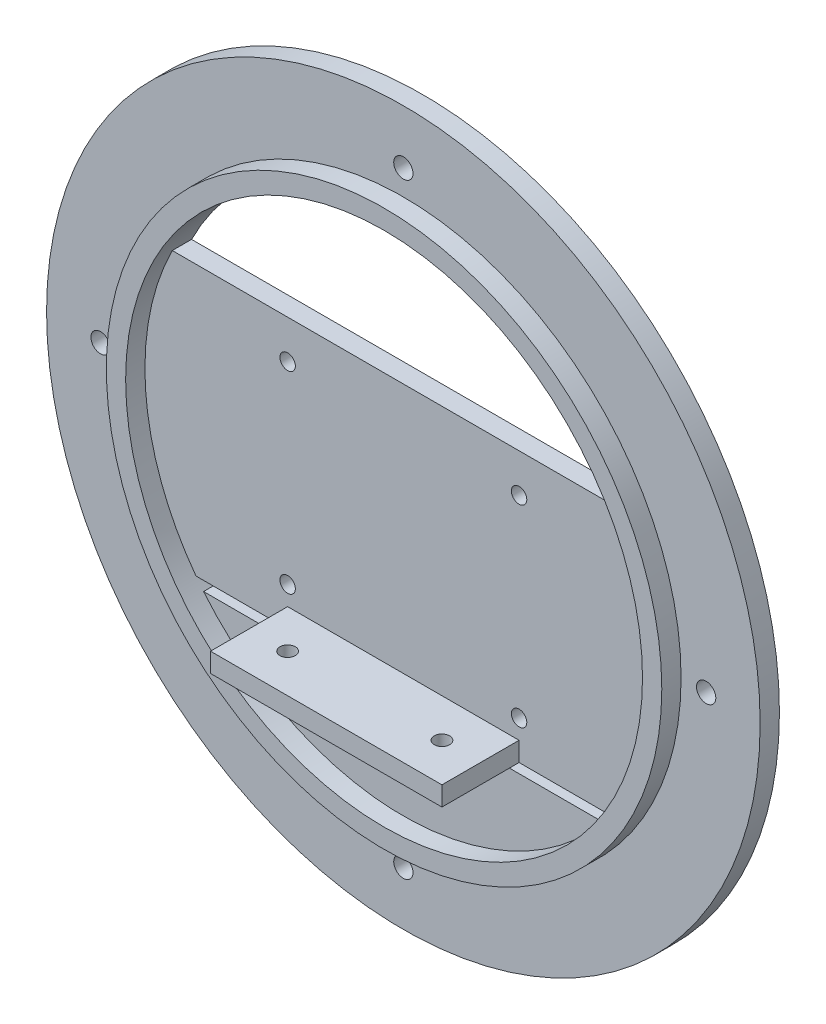
ISO-10303-21;
HEADER;
FILE_DESCRIPTION(('STEP AP214'),'2;1');
FILE_NAME('part.step','',(''),(''),'','','');
FILE_SCHEMA(('AUTOMOTIVE_DESIGN { 1 0 10303 214 1 1 1 1 }'));
ENDSEC;
DATA;
#1=APPLICATION_CONTEXT('core data for automotive mechanical design processes');
#2=APPLICATION_PROTOCOL_DEFINITION('international standard','automotive_design',2000,#1);
#3=PRODUCT_CONTEXT('',#1,'mechanical');
#4=PRODUCT('Part','Part','',(#3));
#5=PRODUCT_RELATED_PRODUCT_CATEGORY('part','',(#4));
#6=PRODUCT_DEFINITION_FORMATION('','',#4);
#7=PRODUCT_DEFINITION_CONTEXT('part definition',#1,'design');
#8=PRODUCT_DEFINITION('design','',#6,#7);
#9=PRODUCT_DEFINITION_SHAPE('','',#8);
#10=(LENGTH_UNIT() NAMED_UNIT(*) SI_UNIT(.MILLI.,.METRE.));
#11=(NAMED_UNIT(*) PLANE_ANGLE_UNIT() SI_UNIT($,.RADIAN.));
#12=(NAMED_UNIT(*) SI_UNIT($,.STERADIAN.) SOLID_ANGLE_UNIT());
#13=UNCERTAINTY_MEASURE_WITH_UNIT(LENGTH_MEASURE(1.E-05),#10,'distance_accuracy_value','');
#14=(GEOMETRIC_REPRESENTATION_CONTEXT(3) GLOBAL_UNCERTAINTY_ASSIGNED_CONTEXT((#13)) GLOBAL_UNIT_ASSIGNED_CONTEXT((#10,
#11,#12)) REPRESENTATION_CONTEXT('',''));
#15=CARTESIAN_POINT('',(0.,0.,0.));
#16=DIRECTION('',(0.,0.,1.));
#17=DIRECTION('',(1.,0.,0.));
#18=AXIS2_PLACEMENT_3D('',#15,#16,#17);
#19=CARTESIAN_POINT('',(0.,0.,5.));
#20=DIRECTION('',(0.,0.,1.));
#21=DIRECTION('',(1.,0.,0.));
#22=AXIS2_PLACEMENT_3D('',#19,#20,#21);
#23=PLANE('',#22);
#24=CARTESIAN_POINT('',(-30.,-30.,5.));
#25=DIRECTION('',(0.,0.,1.));
#26=DIRECTION('',(1.,0.,0.));
#27=AXIS2_PLACEMENT_3D('',#24,#25,#26);
#28=CIRCLE('',#27,2.);
#29=CARTESIAN_POINT('',(-28.,-30.,5.));
#30=VERTEX_POINT('',#29);
#31=EDGE_CURVE('E382',#30,#30,#28,.F.);
#32=ORIENTED_EDGE('',*,*,#31,.T.);
#33=EDGE_LOOP('',(#32));
#34=FACE_BOUND('',#33,.T.);
#35=CARTESIAN_POINT('',(-30.,20.,5.));
#36=DIRECTION('',(0.,0.,1.));
#37=DIRECTION('',(1.,0.,0.));
#38=AXIS2_PLACEMENT_3D('',#35,#36,#37);
#39=CIRCLE('',#38,2.);
#40=CARTESIAN_POINT('',(-28.,20.,5.));
#41=VERTEX_POINT('',#40);
#42=EDGE_CURVE('E376',#41,#41,#39,.F.);
#43=ORIENTED_EDGE('',*,*,#42,.T.);
#44=EDGE_LOOP('',(#43));
#45=FACE_BOUND('',#44,.T.);
#46=CARTESIAN_POINT('',(30.,20.,5.));
#47=DIRECTION('',(0.,0.,1.));
#48=DIRECTION('',(1.,0.,0.));
#49=AXIS2_PLACEMENT_3D('',#46,#47,#48);
#50=CIRCLE('',#49,2.);
#51=CARTESIAN_POINT('',(32.,20.,5.));
#52=VERTEX_POINT('',#51);
#53=EDGE_CURVE('E375',#52,#52,#50,.F.);
#54=ORIENTED_EDGE('',*,*,#53,.T.);
#55=EDGE_LOOP('',(#54));
#56=FACE_BOUND('',#55,.T.);
#57=CARTESIAN_POINT('',(30.,-30.,5.));
#58=DIRECTION('',(0.,0.,1.));
#59=DIRECTION('',(1.,0.,0.));
#60=AXIS2_PLACEMENT_3D('',#57,#58,#59);
#61=CIRCLE('',#60,2.);
#62=CARTESIAN_POINT('',(32.,-30.,5.));
#63=VERTEX_POINT('',#62);
#64=EDGE_CURVE('E134',#63,#63,#61,.F.);
#65=ORIENTED_EDGE('',*,*,#64,.T.);
#66=EDGE_LOOP('',(#65));
#67=FACE_BOUND('',#66,.T.);
#68=DIRECTION('',(-1.,0.,0.));
#69=VECTOR('',#68,1.);
#70=CARTESIAN_POINT('',(30.,-35.,5.));
#71=LINE('',#70,#69);
#72=CARTESIAN_POINT('',(30.,-35.,5.));
#73=VERTEX_POINT('',#72);
#74=CARTESIAN_POINT('',(-30.,-35.,5.));
#75=VERTEX_POINT('',#74);
#76=EDGE_CURVE('E155',#73,#75,#71,.T.);
#77=ORIENTED_EDGE('',*,*,#76,.F.);
#78=DIRECTION('',(0.,1.,0.));
#79=VECTOR('',#78,1.);
#80=CARTESIAN_POINT('',(30.,-40.,5.));
#81=LINE('',#80,#79);
#82=CARTESIAN_POINT('',(30.,-40.,5.));
#83=VERTEX_POINT('',#82);
#84=EDGE_CURVE('E136',#83,#73,#81,.T.);
#85=ORIENTED_EDGE('',*,*,#84,.F.);
#86=DIRECTION('',(-1.,0.,0.));
#87=VECTOR('',#86,1.);
#88=CARTESIAN_POINT('',(-70.,-40.,5.));
#89=LINE('',#88,#87);
#90=CARTESIAN_POINT('',(53.7494186015067,-40.,5.));
#91=VERTEX_POINT('',#90);
#92=EDGE_CURVE('E124',#91,#83,#89,.T.);
#93=ORIENTED_EDGE('',*,*,#92,.F.);
#94=CARTESIAN_POINT('',(0.,0.,5.));
#95=DIRECTION('',(0.,0.,1.));
#96=DIRECTION('',(1.,0.,0.));
#97=AXIS2_PLACEMENT_3D('',#94,#95,#96);
#98=CIRCLE('',#97,67.);
#99=CARTESIAN_POINT('',(59.9082632030007,30.,5.));
#100=VERTEX_POINT('',#99);
#101=EDGE_CURVE('E186',#100,#91,#98,.F.);
#102=ORIENTED_EDGE('',*,*,#101,.F.);
#103=DIRECTION('',(1.,0.,0.));
#104=VECTOR('',#103,1.);
#105=CARTESIAN_POINT('',(-70.,30.,5.));
#106=LINE('',#105,#104);
#107=CARTESIAN_POINT('',(-59.9082632030007,30.,5.));
#108=VERTEX_POINT('',#107);
#109=EDGE_CURVE('E168',#108,#100,#106,.T.);
#110=ORIENTED_EDGE('',*,*,#109,.F.);
#111=CARTESIAN_POINT('',(-53.7494186015068,-40.,5.));
#112=VERTEX_POINT('',#111);
#113=EDGE_CURVE('E194',#112,#108,#98,.F.);
#114=ORIENTED_EDGE('',*,*,#113,.F.);
#115=CARTESIAN_POINT('',(-30.,-40.,5.));
#116=VERTEX_POINT('',#115);
#117=EDGE_CURVE('E171',#116,#112,#89,.T.);
#118=ORIENTED_EDGE('',*,*,#117,.F.);
#119=DIRECTION('',(0.,-1.,0.));
#120=VECTOR('',#119,1.);
#121=CARTESIAN_POINT('',(-30.,-40.,5.));
#122=LINE('',#121,#120);
#123=EDGE_CURVE('E146',#75,#116,#122,.T.);
#124=ORIENTED_EDGE('',*,*,#123,.F.);
#125=EDGE_LOOP('',(#77,#85,#93,#102,#110,#114,#118,#124));
#126=FACE_BOUND('',#125,.T.);
#127=ADVANCED_FACE('F34',(#34,#45,#56,#67,#126),#23,.T.);
#128=CARTESIAN_POINT('',(0.,0.,5.));
#129=DIRECTION('',(0.,0.,-1.));
#130=DIRECTION('',(-1.,0.,0.));
#131=AXIS2_PLACEMENT_3D('',#128,#129,#130);
#132=CYLINDRICAL_SURFACE('',#131,92.5);
#133=CARTESIAN_POINT('',(0.,0.,5.));
#134=DIRECTION('',(0.,0.,1.));
#135=DIRECTION('',(1.,0.,0.));
#136=AXIS2_PLACEMENT_3D('',#133,#134,#135);
#137=CIRCLE('',#136,92.5);
#138=CARTESIAN_POINT('',(92.5,0.,5.));
#139=VERTEX_POINT('',#138);
#140=EDGE_CURVE('E187',#139,#139,#137,.T.);
#141=ORIENTED_EDGE('',*,*,#140,.F.);
#142=EDGE_LOOP('',(#141));
#143=FACE_BOUND('',#142,.T.);
#144=CARTESIAN_POINT('',(0.,0.,0.));
#145=DIRECTION('',(0.,0.,1.));
#146=DIRECTION('',(1.,0.,0.));
#147=AXIS2_PLACEMENT_3D('',#144,#145,#146);
#148=CIRCLE('',#147,92.5);
#149=CARTESIAN_POINT('',(92.5,0.,0.));
#150=VERTEX_POINT('',#149);
#151=EDGE_CURVE('E182',#150,#150,#148,.T.);
#152=ORIENTED_EDGE('',*,*,#151,.T.);
#153=EDGE_LOOP('',(#152));
#154=FACE_BOUND('',#153,.T.);
#155=ADVANCED_FACE('F239',(#143,#154),#132,.T.);
#156=CARTESIAN_POINT('',(0.,0.,5.));
#157=DIRECTION('',(0.,0.,1.));
#158=DIRECTION('',(1.,0.,0.));
#159=AXIS2_PLACEMENT_3D('',#156,#157,#158);
#160=PLANE('',#159);
#161=CARTESIAN_POINT('',(0.,-78.5,5.));
#162=DIRECTION('',(0.,0.,1.));
#163=DIRECTION('',(1.,0.,0.));
#164=AXIS2_PLACEMENT_3D('',#161,#162,#163);
#165=CIRCLE('',#164,2.5);
#166=CARTESIAN_POINT('',(2.5,-78.5,5.));
#167=VERTEX_POINT('',#166);
#168=EDGE_CURVE('E350',#167,#167,#165,.F.);
#169=ORIENTED_EDGE('',*,*,#168,.T.);
#170=EDGE_LOOP('',(#169));
#171=FACE_BOUND('',#170,.T.);
#172=CARTESIAN_POINT('',(78.5,0.,5.));
#173=DIRECTION('',(0.,0.,1.));
#174=DIRECTION('',(1.,0.,0.));
#175=AXIS2_PLACEMENT_3D('',#172,#173,#174);
#176=CIRCLE('',#175,2.50000000000001);
#177=CARTESIAN_POINT('',(81.,0.,5.));
#178=VERTEX_POINT('',#177);
#179=EDGE_CURVE('E351',#178,#178,#176,.F.);
#180=ORIENTED_EDGE('',*,*,#179,.T.);
#181=EDGE_LOOP('',(#180));
#182=FACE_BOUND('',#181,.T.);
#183=CARTESIAN_POINT('',(0.,78.5,5.));
#184=DIRECTION('',(0.,0.,1.));
#185=DIRECTION('',(1.,0.,0.));
#186=AXIS2_PLACEMENT_3D('',#183,#184,#185);
#187=CIRCLE('',#186,2.5);
#188=CARTESIAN_POINT('',(2.5,78.5,5.));
#189=VERTEX_POINT('',#188);
#190=EDGE_CURVE('E358',#189,#189,#187,.F.);
#191=ORIENTED_EDGE('',*,*,#190,.T.);
#192=EDGE_LOOP('',(#191));
#193=FACE_BOUND('',#192,.T.);
#194=CARTESIAN_POINT('',(-78.5,0.,5.));
#195=DIRECTION('',(0.,0.,1.));
#196=DIRECTION('',(1.,0.,0.));
#197=AXIS2_PLACEMENT_3D('',#194,#195,#196);
#198=CIRCLE('',#197,2.49999999999999);
#199=CARTESIAN_POINT('',(-76.,0.,5.));
#200=VERTEX_POINT('',#199);
#201=EDGE_CURVE('E364',#200,#200,#198,.F.);
#202=ORIENTED_EDGE('',*,*,#201,.T.);
#203=EDGE_LOOP('',(#202));
#204=FACE_BOUND('',#203,.T.);
#205=CARTESIAN_POINT('',(0.,0.,5.));
#206=DIRECTION('',(0.,0.,1.));
#207=DIRECTION('',(1.,0.,0.));
#208=AXIS2_PLACEMENT_3D('',#205,#206,#207);
#209=CIRCLE('',#208,72.);
#210=CARTESIAN_POINT('',(72.,0.,5.));
#211=VERTEX_POINT('',#210);
#212=EDGE_CURVE('E183',#211,#211,#209,.T.);
#213=ORIENTED_EDGE('',*,*,#212,.F.);
#214=EDGE_LOOP('',(#213));
#215=FACE_BOUND('',#214,.T.);
#216=ORIENTED_EDGE('',*,*,#140,.T.);
#217=EDGE_LOOP('',(#216));
#218=FACE_BOUND('',#217,.T.);
#219=ADVANCED_FACE('F236',(#171,#182,#193,#204,#215,#218),#160,.T.);
#220=CARTESIAN_POINT('',(0.,0.,0.));
#221=DIRECTION('',(0.,0.,1.));
#222=DIRECTION('',(1.,0.,0.));
#223=AXIS2_PLACEMENT_3D('',#220,#221,#222);
#224=PLANE('',#223);
#225=CARTESIAN_POINT('',(0.,-78.5,0.));
#226=DIRECTION('',(0.,0.,-1.));
#227=DIRECTION('',(-1.,0.,0.));
#228=AXIS2_PLACEMENT_3D('',#225,#226,#227);
#229=CIRCLE('',#228,2.5);
#230=CARTESIAN_POINT('',(-2.5,-78.5,0.));
#231=VERTEX_POINT('',#230);
#232=EDGE_CURVE('E347',#231,#231,#229,.T.);
#233=ORIENTED_EDGE('',*,*,#232,.F.);
#234=EDGE_LOOP('',(#233));
#235=FACE_BOUND('',#234,.T.);
#236=CARTESIAN_POINT('',(78.5,0.,0.));
#237=DIRECTION('',(0.,0.,-1.));
#238=DIRECTION('',(-1.,0.,0.));
#239=AXIS2_PLACEMENT_3D('',#236,#237,#238);
#240=CIRCLE('',#239,2.50000000000001);
#241=CARTESIAN_POINT('',(76.,0.,0.));
#242=VERTEX_POINT('',#241);
#243=EDGE_CURVE('E355',#242,#242,#240,.T.);
#244=ORIENTED_EDGE('',*,*,#243,.F.);
#245=EDGE_LOOP('',(#244));
#246=FACE_BOUND('',#245,.T.);
#247=CARTESIAN_POINT('',(0.,78.5,0.));
#248=DIRECTION('',(0.,0.,-1.));
#249=DIRECTION('',(-1.,0.,0.));
#250=AXIS2_PLACEMENT_3D('',#247,#248,#249);
#251=CIRCLE('',#250,2.5);
#252=CARTESIAN_POINT('',(-2.5,78.5,0.));
#253=VERTEX_POINT('',#252);
#254=EDGE_CURVE('E361',#253,#253,#251,.T.);
#255=ORIENTED_EDGE('',*,*,#254,.F.);
#256=EDGE_LOOP('',(#255));
#257=FACE_BOUND('',#256,.T.);
#258=CARTESIAN_POINT('',(-78.5,0.,0.));
#259=DIRECTION('',(0.,0.,-1.));
#260=DIRECTION('',(-1.,0.,0.));
#261=AXIS2_PLACEMENT_3D('',#258,#259,#260);
#262=CIRCLE('',#261,2.49999999999999);
#263=CARTESIAN_POINT('',(-81.,0.,0.));
#264=VERTEX_POINT('',#263);
#265=EDGE_CURVE('E367',#264,#264,#262,.T.);
#266=ORIENTED_EDGE('',*,*,#265,.F.);
#267=EDGE_LOOP('',(#266));
#268=FACE_BOUND('',#267,.T.);
#269=CARTESIAN_POINT('',(-30.,-30.,0.));
#270=DIRECTION('',(0.,0.,-1.));
#271=DIRECTION('',(-1.,0.,0.));
#272=AXIS2_PLACEMENT_3D('',#269,#270,#271);
#273=CIRCLE('',#272,2.);
#274=CARTESIAN_POINT('',(-32.,-30.,0.));
#275=VERTEX_POINT('',#274);
#276=EDGE_CURVE('E354',#275,#275,#273,.T.);
#277=ORIENTED_EDGE('',*,*,#276,.F.);
#278=EDGE_LOOP('',(#277));
#279=FACE_BOUND('',#278,.T.);
#280=CARTESIAN_POINT('',(-30.,20.,0.));
#281=DIRECTION('',(0.,0.,-1.));
#282=DIRECTION('',(-1.,0.,0.));
#283=AXIS2_PLACEMENT_3D('',#280,#281,#282);
#284=CIRCLE('',#283,2.);
#285=CARTESIAN_POINT('',(-32.,20.,0.));
#286=VERTEX_POINT('',#285);
#287=EDGE_CURVE('E379',#286,#286,#284,.T.);
#288=ORIENTED_EDGE('',*,*,#287,.F.);
#289=EDGE_LOOP('',(#288));
#290=FACE_BOUND('',#289,.T.);
#291=CARTESIAN_POINT('',(30.,20.,0.));
#292=DIRECTION('',(0.,0.,-1.));
#293=DIRECTION('',(-1.,0.,0.));
#294=AXIS2_PLACEMENT_3D('',#291,#292,#293);
#295=CIRCLE('',#294,2.);
#296=CARTESIAN_POINT('',(28.,20.,0.));
#297=VERTEX_POINT('',#296);
#298=EDGE_CURVE('E372',#297,#297,#295,.T.);
#299=ORIENTED_EDGE('',*,*,#298,.F.);
#300=EDGE_LOOP('',(#299));
#301=FACE_BOUND('',#300,.T.);
#302=CARTESIAN_POINT('',(30.,-30.,0.));
#303=DIRECTION('',(0.,0.,-1.));
#304=DIRECTION('',(-1.,0.,0.));
#305=AXIS2_PLACEMENT_3D('',#302,#303,#304);
#306=CIRCLE('',#305,2.);
#307=CARTESIAN_POINT('',(28.,-30.,0.));
#308=VERTEX_POINT('',#307);
#309=EDGE_CURVE('E139',#308,#308,#306,.T.);
#310=ORIENTED_EDGE('',*,*,#309,.F.);
#311=EDGE_LOOP('',(#310));
#312=FACE_BOUND('',#311,.T.);
#313=DIRECTION('',(1.,0.,0.));
#314=VECTOR('',#313,1.);
#315=CARTESIAN_POINT('',(55.,-42.5,0.));
#316=LINE('',#315,#314);
#317=CARTESIAN_POINT('',(-51.7952700543206,-42.5,0.));
#318=VERTEX_POINT('',#317);
#319=CARTESIAN_POINT('',(51.7952700543206,-42.5,0.));
#320=VERTEX_POINT('',#319);
#321=EDGE_CURVE('E119',#318,#320,#316,.T.);
#322=ORIENTED_EDGE('',*,*,#321,.T.);
#323=CARTESIAN_POINT('',(0.,0.,0.));
#324=DIRECTION('',(0.,0.,-1.));
#325=DIRECTION('',(-1.,0.,0.));
#326=AXIS2_PLACEMENT_3D('',#323,#324,#325);
#327=CIRCLE('',#326,67.);
#328=CARTESIAN_POINT('',(55.52251795443,-37.5,0.));
#329=VERTEX_POINT('',#328);
#330=EDGE_CURVE('E123',#329,#320,#327,.T.);
#331=ORIENTED_EDGE('',*,*,#330,.F.);
#332=DIRECTION('',(-1.,0.,0.));
#333=VECTOR('',#332,1.);
#334=CARTESIAN_POINT('',(-53.7494186015068,-37.5,0.));
#335=LINE('',#334,#333);
#336=CARTESIAN_POINT('',(-55.52251795443,-37.5,0.));
#337=VERTEX_POINT('',#336);
#338=EDGE_CURVE('E121',#329,#337,#335,.T.);
#339=ORIENTED_EDGE('',*,*,#338,.T.);
#340=EDGE_CURVE('E115',#318,#337,#327,.T.);
#341=ORIENTED_EDGE('',*,*,#340,.F.);
#342=EDGE_LOOP('',(#322,#331,#339,#341));
#343=FACE_BOUND('',#342,.T.);
#344=DIRECTION('',(1.,0.,0.));
#345=VECTOR('',#344,1.);
#346=CARTESIAN_POINT('',(-70.,30.,0.));
#347=LINE('',#346,#345);
#348=CARTESIAN_POINT('',(-59.9082632030007,30.,0.));
#349=VERTEX_POINT('',#348);
#350=CARTESIAN_POINT('',(59.9082632030007,30.,0.));
#351=VERTEX_POINT('',#350);
#352=EDGE_CURVE('E167',#349,#351,#347,.T.);
#353=ORIENTED_EDGE('',*,*,#352,.T.);
#354=EDGE_CURVE('E126',#349,#351,#327,.T.);
#355=ORIENTED_EDGE('',*,*,#354,.F.);
#356=EDGE_LOOP('',(#353,#355));
#357=FACE_BOUND('',#356,.T.);
#358=ORIENTED_EDGE('',*,*,#151,.F.);
#359=EDGE_LOOP('',(#358));
#360=FACE_BOUND('',#359,.T.);
#361=ADVANCED_FACE('F116',(#235,#246,#257,#268,#279,#290,#301,#312,#343,#357,#360),#224,.F.);
#362=CARTESIAN_POINT('',(0.,0.,10.));
#363=DIRECTION('',(0.,0.,-1.));
#364=DIRECTION('',(-1.,0.,0.));
#365=AXIS2_PLACEMENT_3D('',#362,#363,#364);
#366=CYLINDRICAL_SURFACE('',#365,72.);
#367=CARTESIAN_POINT('',(0.,0.,10.));
#368=DIRECTION('',(0.,0.,1.));
#369=DIRECTION('',(1.,0.,0.));
#370=AXIS2_PLACEMENT_3D('',#367,#368,#369);
#371=CIRCLE('',#370,72.);
#372=CARTESIAN_POINT('',(72.,0.,10.));
#373=VERTEX_POINT('',#372);
#374=EDGE_CURVE('E178',#373,#373,#371,.T.);
#375=ORIENTED_EDGE('',*,*,#374,.F.);
#376=EDGE_LOOP('',(#375));
#377=FACE_BOUND('',#376,.T.);
#378=ORIENTED_EDGE('',*,*,#212,.T.);
#379=EDGE_LOOP('',(#378));
#380=FACE_BOUND('',#379,.T.);
#381=ADVANCED_FACE('F231',(#377,#380),#366,.T.);
#382=CARTESIAN_POINT('',(0.,0.,10.));
#383=DIRECTION('',(0.,0.,1.));
#384=DIRECTION('',(1.,0.,0.));
#385=AXIS2_PLACEMENT_3D('',#382,#383,#384);
#386=PLANE('',#385);
#387=CARTESIAN_POINT('',(0.,0.,10.));
#388=DIRECTION('',(0.,0.,-1.));
#389=DIRECTION('',(-1.,0.,0.));
#390=AXIS2_PLACEMENT_3D('',#387,#388,#389);
#391=CIRCLE('',#390,67.);
#392=CARTESIAN_POINT('',(-67.,0.,10.));
#393=VERTEX_POINT('',#392);
#394=EDGE_CURVE('E176',#393,#393,#391,.T.);
#395=ORIENTED_EDGE('',*,*,#394,.T.);
#396=EDGE_LOOP('',(#395));
#397=FACE_BOUND('',#396,.T.);
#398=ORIENTED_EDGE('',*,*,#374,.T.);
#399=EDGE_LOOP('',(#398));
#400=FACE_BOUND('',#399,.T.);
#401=ADVANCED_FACE('F225',(#397,#400),#386,.T.);
#402=CARTESIAN_POINT('',(0.,0.,10.));
#403=DIRECTION('',(0.,0.,-1.));
#404=DIRECTION('',(-1.,0.,0.));
#405=AXIS2_PLACEMENT_3D('',#402,#403,#404);
#406=CYLINDRICAL_SURFACE('',#405,67.);
#407=ORIENTED_EDGE('',*,*,#330,.T.);
#408=DIRECTION('',(0.,0.,-1.));
#409=VECTOR('',#408,1.);
#410=CARTESIAN_POINT('',(51.7952700543206,-42.5,10.));
#411=LINE('',#410,#409);
#412=CARTESIAN_POINT('',(51.7952700543206,-42.5,5.));
#413=VERTEX_POINT('',#412);
#414=EDGE_CURVE('E11',#320,#413,#411,.F.);
#415=ORIENTED_EDGE('',*,*,#414,.T.);
#416=CARTESIAN_POINT('',(0.,0.,5.));
#417=DIRECTION('',(0.,0.,-1.));
#418=DIRECTION('',(-1.,0.,0.));
#419=AXIS2_PLACEMENT_3D('',#416,#417,#418);
#420=CIRCLE('',#419,67.);
#421=CARTESIAN_POINT('',(-51.7952700543206,-42.5,5.));
#422=VERTEX_POINT('',#421);
#423=EDGE_CURVE('E52',#422,#413,#420,.F.);
#424=ORIENTED_EDGE('',*,*,#423,.F.);
#425=DIRECTION('',(0.,0.,-1.));
#426=VECTOR('',#425,1.);
#427=CARTESIAN_POINT('',(-51.7952700543206,-42.5,10.));
#428=LINE('',#427,#426);
#429=EDGE_CURVE('E43',#422,#318,#428,.T.);
#430=ORIENTED_EDGE('',*,*,#429,.T.);
#431=ORIENTED_EDGE('',*,*,#340,.T.);
#432=CARTESIAN_POINT('',(-55.52251795443,-37.5,0.));
#433=CARTESIAN_POINT('',(-55.4632440830582,-37.58776320925,1.588865583409E-05));
#434=CARTESIAN_POINT('',(-55.4037949976396,-37.6753318881441,0.00462328313600626));
#435=CARTESIAN_POINT('',(-55.2849136580255,-37.8495631871308,0.0230045283893117));
#436=CARTESIAN_POINT('',(-55.2254814194392,-37.9362254404987,0.0367819537786903));
#437=CARTESIAN_POINT('',(-55.046934102485,-38.1952750780284,0.0921170171802291));
#438=CARTESIAN_POINT('',(-54.9284785371727,-38.3653785083892,0.147677694833614));
#439=CARTESIAN_POINT('',(-54.7032524907535,-38.6857968416439,0.292416472417243));
#440=CARTESIAN_POINT('',(-54.5961953250302,-38.836661167315,0.379939047007094));
#441=CARTESIAN_POINT('',(-54.3928966144718,-39.120877531332,0.588564159533133));
#442=CARTESIAN_POINT('',(-54.2966099752949,-39.2543030116989,0.709518717677333));
#443=CARTESIAN_POINT('',(-54.1489938820084,-39.4575332552187,0.940009284231443));
#444=CARTESIAN_POINT('',(-54.0931390834981,-39.5340323071798,1.04080871983558));
#445=CARTESIAN_POINT('',(-53.9915237891939,-39.6726950065866,1.25670255587298));
#446=CARTESIAN_POINT('',(-53.945763710393,-39.7348580618454,1.37179754652063));
#447=CARTESIAN_POINT('',(-53.8865916762624,-39.8150268539274,1.55388687777492));
#448=CARTESIAN_POINT('',(-53.868377872019,-39.8396614985135,1.61649950453075));
#449=CARTESIAN_POINT('',(-53.8355445416251,-39.884018150131,1.74433894499644));
#450=CARTESIAN_POINT('',(-53.820922982202,-39.9037429363109,1.80956425545199));
#451=CARTESIAN_POINT('',(-53.7955927243815,-39.9378849727522,1.94198102060025));
#452=CARTESIAN_POINT('',(-53.7848760407399,-39.9523130549253,2.00916815590287));
#453=CARTESIAN_POINT('',(-53.7675543069141,-39.9756215256442,2.14498269715764));
#454=CARTESIAN_POINT('',(-53.7609459955989,-39.9845063143483,2.21360891594969));
#455=CARTESIAN_POINT('',(-53.7541193844086,-39.9936827884614,2.31871838562667));
#456=CARTESIAN_POINT('',(-53.7523566780077,-39.9960517736335,2.35493673306331));
#457=CARTESIAN_POINT('',(-53.7500067049264,-39.9992097558051,2.4274345606377));
#458=CARTESIAN_POINT('',(-53.749417963693,-40.0000007348516,2.46371390672953));
#459=CARTESIAN_POINT('',(-53.7494186015068,-40.,2.5));
#460=B_SPLINE_CURVE_WITH_KNOTS('',3,(#432,#433,#434,#435,#436,#437,#438,#439,#440,#441,#442,
#443,#444,#445,#446,#447,#448,#449,#450,#451,#452,#453,#454,#455,#456,#457,#458,#459),
.UNSPECIFIED.,.F.,.F.,(4,2,2,2,2,2,2,2,2,2,2,2,2,4),(0.,0.317488136792001,0.635100107785104,
1.27513520139012,1.8858682446488,2.49394013888756,2.90738515469495,3.32084724590526,
3.52970599118443,3.73844624502665,3.94675720920705,4.15490260912474,4.26387116804923,
4.37270277114536),.UNSPECIFIED.);
#461=CARTESIAN_POINT('',(-53.7494186015068,-40.,2.5));
#462=VERTEX_POINT('',#461);
#463=EDGE_CURVE('E207',#337,#462,#460,.T.);
#464=ORIENTED_EDGE('',*,*,#463,.T.);
#465=DIRECTION('',(0.,0.,-1.));
#466=VECTOR('',#465,1.);
#467=CARTESIAN_POINT('',(-53.7494186015068,-40.,10.));
#468=LINE('',#467,#466);
#469=EDGE_CURVE('E202',#462,#112,#468,.F.);
#470=ORIENTED_EDGE('',*,*,#469,.T.);
#471=ORIENTED_EDGE('',*,*,#113,.T.);
#472=DIRECTION('',(0.,0.,-1.));
#473=VECTOR('',#472,1.);
#474=CARTESIAN_POINT('',(-59.9082632030007,30.,10.));
#475=LINE('',#474,#473);
#476=EDGE_CURVE('E199',#108,#349,#475,.T.);
#477=ORIENTED_EDGE('',*,*,#476,.T.);
#478=ORIENTED_EDGE('',*,*,#354,.T.);
#479=DIRECTION('',(0.,0.,-1.));
#480=VECTOR('',#479,1.);
#481=CARTESIAN_POINT('',(59.9082632030007,30.,10.));
#482=LINE('',#481,#480);
#483=EDGE_CURVE('E193',#351,#100,#482,.F.);
#484=ORIENTED_EDGE('',*,*,#483,.T.);
#485=ORIENTED_EDGE('',*,*,#101,.T.);
#486=DIRECTION('',(0.,0.,-1.));
#487=VECTOR('',#486,1.);
#488=CARTESIAN_POINT('',(53.7494186015067,-40.,10.));
#489=LINE('',#488,#487);
#490=CARTESIAN_POINT('',(53.7494186015067,-40.,2.5));
#491=VERTEX_POINT('',#490);
#492=EDGE_CURVE('E196',#91,#491,#489,.T.);
#493=ORIENTED_EDGE('',*,*,#492,.T.);
#494=CARTESIAN_POINT('',(53.7494186015067,-40.,2.5));
#495=CARTESIAN_POINT('',(53.7494085114287,-40.0000123908809,2.43930959965619));
#496=CARTESIAN_POINT('',(53.7510629600194,-39.9977903909757,2.37862744942735));
#497=CARTESIAN_POINT('',(53.7576237294607,-39.9889728034297,2.25778918899682));
#498=CARTESIAN_POINT('',(53.762528370558,-39.982379474963,2.19763282332367));
#499=CARTESIAN_POINT('',(53.7754736405455,-39.9649664693916,2.07864886097415));
#500=CARTESIAN_POINT('',(53.7834953392095,-39.954172303825,2.01981546916449));
#501=CARTESIAN_POINT('',(53.8025300025628,-39.9285364081723,1.90354362752521));
#502=CARTESIAN_POINT('',(53.8135432126914,-39.913694345975,1.84610529257481));
#503=CARTESIAN_POINT('',(53.8507770190097,-39.8634614902711,1.6766690494055));
#504=CARTESIAN_POINT('',(53.8812276549487,-39.8223159837194,1.56723154797739));
#505=CARTESIAN_POINT('',(53.9517399480183,-39.7267323945261,1.35763978467214));
#506=CARTESIAN_POINT('',(53.9918147643792,-39.6722761101049,1.25749849581147));
#507=CARTESIAN_POINT('',(54.0830591523657,-39.5478075543817,1.06090463101593));
#508=CARTESIAN_POINT('',(54.1348307662797,-39.4769416456489,0.965275116577705));
#509=CARTESIAN_POINT('',(54.2453732440932,-39.3249071822827,0.787272728104595));
#510=CARTESIAN_POINT('',(54.304145682763,-39.2437363093727,0.704902846535596));
#511=CARTESIAN_POINT('',(54.4386421079447,-39.0570075463906,0.539360695898549));
#512=CARTESIAN_POINT('',(54.5154659174583,-38.9497455350817,0.459005475765163));
#513=CARTESIAN_POINT('',(54.6742375914399,-38.7265613270561,0.317562077150722));
#514=CARTESIAN_POINT('',(54.7561914205947,-38.610629017688,0.256496845153551));
#515=CARTESIAN_POINT('',(54.9386074182777,-38.3507366819709,0.144197336630406));
#516=CARTESIAN_POINT('',(55.03970110147,-38.2055437949092,0.0968376912570801));
#517=CARTESIAN_POINT('',(55.2434429881226,-37.910342391821,0.0292728829770364));
#518=CARTESIAN_POINT('',(55.3460883441206,-37.7603422372724,0.0090229400905055));
#519=CARTESIAN_POINT('',(55.4730660388496,-37.5731412380005,0.000802618745671298));
#520=CARTESIAN_POINT('',(55.4978142386588,-37.5365773624677,-1.45496067119308E-07));
#521=CARTESIAN_POINT('',(55.52251795443,-37.5,0.));
#522=B_SPLINE_CURVE_WITH_KNOTS('',3,(#494,#495,#496,#497,#498,#499,#500,#501,#502,#503,#504,
#505,#506,#507,#508,#509,#510,#511,#512,#513,#514,#515,#516,#517,#518,#519,#520,#521),
.UNSPECIFIED.,.F.,.F.,(4,2,2,2,2,2,2,2,2,2,2,2,2,4),(0.,0.181994419737893,0.363894855029514,
0.544707433052058,0.725534850370069,1.08623042832009,1.44742202504253,1.83537540596981,
2.22341621877373,2.68513323558594,3.14739743933252,3.69469408200092,4.24108557653509,
4.37353100076493),.UNSPECIFIED.);
#523=EDGE_CURVE('E214',#491,#329,#522,.T.);
#524=ORIENTED_EDGE('',*,*,#523,.T.);
#525=EDGE_LOOP('',(#407,#415,#424,#430,#431,#464,#470,#471,#477,#478,#484,#485,#493,#524));
#526=FACE_BOUND('',#525,.T.);
#527=ORIENTED_EDGE('',*,*,#394,.F.);
#528=EDGE_LOOP('',(#527));
#529=FACE_BOUND('',#528,.T.);
#530=ADVANCED_FACE('F127',(#526,#529),#406,.F.);
#531=CARTESIAN_POINT('',(-70.,-40.,5.));
#532=DIRECTION('',(0.,-1.,0.));
#533=DIRECTION('',(1.,0.,0.));
#534=AXIS2_PLACEMENT_3D('',#531,#532,#533);
#535=PLANE('',#534);
#536=CARTESIAN_POINT('',(-20.,-40.,15.));
#537=DIRECTION('',(0.,-1.,0.));
#538=DIRECTION('',(1.,0.,0.));
#539=AXIS2_PLACEMENT_3D('',#536,#537,#538);
#540=CIRCLE('',#539,2.);
#541=CARTESIAN_POINT('',(-18.,-40.,15.));
#542=VERTEX_POINT('',#541);
#543=EDGE_CURVE('E273',#542,#542,#540,.F.);
#544=ORIENTED_EDGE('',*,*,#543,.T.);
#545=EDGE_LOOP('',(#544));
#546=FACE_BOUND('',#545,.T.);
#547=CARTESIAN_POINT('',(20.,-40.,15.));
#548=DIRECTION('',(0.,-1.,0.));
#549=DIRECTION('',(1.,0.,0.));
#550=AXIS2_PLACEMENT_3D('',#547,#548,#549);
#551=CIRCLE('',#550,2.);
#552=CARTESIAN_POINT('',(22.,-40.,15.));
#553=VERTEX_POINT('',#552);
#554=EDGE_CURVE('E277',#553,#553,#551,.F.);
#555=ORIENTED_EDGE('',*,*,#554,.T.);
#556=EDGE_LOOP('',(#555));
#557=FACE_BOUND('',#556,.T.);
#558=ORIENTED_EDGE('',*,*,#469,.F.);
#559=DIRECTION('',(-1.,0.,0.));
#560=VECTOR('',#559,1.);
#561=CARTESIAN_POINT('',(53.7494186015067,-40.,2.5));
#562=LINE('',#561,#560);
#563=EDGE_CURVE('E205',#462,#491,#562,.F.);
#564=ORIENTED_EDGE('',*,*,#563,.T.);
#565=ORIENTED_EDGE('',*,*,#492,.F.);
#566=ORIENTED_EDGE('',*,*,#92,.T.);
#567=DIRECTION('',(0.,0.,-1.));
#568=VECTOR('',#567,1.);
#569=CARTESIAN_POINT('',(30.,-40.,25.));
#570=LINE('',#569,#568);
#571=CARTESIAN_POINT('',(30.,-40.,25.));
#572=VERTEX_POINT('',#571);
#573=EDGE_CURVE('E152',#572,#83,#570,.T.);
#574=ORIENTED_EDGE('',*,*,#573,.F.);
#575=DIRECTION('',(1.,0.,0.));
#576=VECTOR('',#575,1.);
#577=CARTESIAN_POINT('',(30.,-40.,25.));
#578=LINE('',#577,#576);
#579=CARTESIAN_POINT('',(-30.,-40.,25.));
#580=VERTEX_POINT('',#579);
#581=EDGE_CURVE('E150',#580,#572,#578,.T.);
#582=ORIENTED_EDGE('',*,*,#581,.F.);
#583=DIRECTION('',(0.,0.,-1.));
#584=VECTOR('',#583,1.);
#585=CARTESIAN_POINT('',(-30.,-40.,25.));
#586=LINE('',#585,#584);
#587=EDGE_CURVE('E160',#580,#116,#586,.T.);
#588=ORIENTED_EDGE('',*,*,#587,.T.);
#589=ORIENTED_EDGE('',*,*,#117,.T.);
#590=EDGE_LOOP('',(#558,#564,#565,#566,#574,#582,#588,#589));
#591=FACE_BOUND('',#590,.T.);
#592=ADVANCED_FACE('F224',(#546,#557,#591),#535,.T.);
#593=CARTESIAN_POINT('',(-70.,30.,5.));
#594=DIRECTION('',(0.,1.,0.));
#595=DIRECTION('',(-1.,0.,0.));
#596=AXIS2_PLACEMENT_3D('',#593,#594,#595);
#597=PLANE('',#596);
#598=ORIENTED_EDGE('',*,*,#483,.F.);
#599=ORIENTED_EDGE('',*,*,#352,.F.);
#600=ORIENTED_EDGE('',*,*,#476,.F.);
#601=ORIENTED_EDGE('',*,*,#109,.T.);
#602=EDGE_LOOP('',(#598,#599,#600,#601));
#603=FACE_BOUND('',#602,.T.);
#604=ADVANCED_FACE('F226',(#603),#597,.T.);
#605=CARTESIAN_POINT('',(30.,-40.,25.));
#606=DIRECTION('',(-1.,0.,0.));
#607=DIRECTION('',(0.,0.,1.));
#608=AXIS2_PLACEMENT_3D('',#605,#606,#607);
#609=PLANE('',#608);
#610=ORIENTED_EDGE('',*,*,#84,.T.);
#611=DIRECTION('',(0.,0.,-1.));
#612=VECTOR('',#611,1.);
#613=CARTESIAN_POINT('',(30.,-35.,25.));
#614=LINE('',#613,#612);
#615=CARTESIAN_POINT('',(30.,-35.,25.));
#616=VERTEX_POINT('',#615);
#617=EDGE_CURVE('E165',#616,#73,#614,.T.);
#618=ORIENTED_EDGE('',*,*,#617,.F.);
#619=DIRECTION('',(0.,1.,0.));
#620=VECTOR('',#619,1.);
#621=CARTESIAN_POINT('',(30.,-40.,25.));
#622=LINE('',#621,#620);
#623=EDGE_CURVE('E142',#572,#616,#622,.T.);
#624=ORIENTED_EDGE('',*,*,#623,.F.);
#625=ORIENTED_EDGE('',*,*,#573,.T.);
#626=EDGE_LOOP('',(#610,#618,#624,#625));
#627=FACE_BOUND('',#626,.T.);
#628=ADVANCED_FACE('F260',(#627),#609,.F.);
#629=CARTESIAN_POINT('',(30.,-35.,25.));
#630=DIRECTION('',(0.,-1.,0.));
#631=DIRECTION('',(1.,0.,0.));
#632=AXIS2_PLACEMENT_3D('',#629,#630,#631);
#633=PLANE('',#632);
#634=CARTESIAN_POINT('',(-20.,-35.,15.));
#635=DIRECTION('',(0.,1.,0.));
#636=DIRECTION('',(-1.,0.,0.));
#637=AXIS2_PLACEMENT_3D('',#634,#635,#636);
#638=CIRCLE('',#637,2.);
#639=CARTESIAN_POINT('',(-22.,-35.,15.));
#640=VERTEX_POINT('',#639);
#641=EDGE_CURVE('E319',#640,#640,#638,.T.);
#642=ORIENTED_EDGE('',*,*,#641,.F.);
#643=EDGE_LOOP('',(#642));
#644=FACE_BOUND('',#643,.T.);
#645=CARTESIAN_POINT('',(20.,-35.,15.));
#646=DIRECTION('',(0.,1.,0.));
#647=DIRECTION('',(-1.,0.,0.));
#648=AXIS2_PLACEMENT_3D('',#645,#646,#647);
#649=CIRCLE('',#648,2.);
#650=CARTESIAN_POINT('',(18.,-35.,15.));
#651=VERTEX_POINT('',#650);
#652=EDGE_CURVE('E323',#651,#651,#649,.T.);
#653=ORIENTED_EDGE('',*,*,#652,.F.);
#654=EDGE_LOOP('',(#653));
#655=FACE_BOUND('',#654,.T.);
#656=ORIENTED_EDGE('',*,*,#76,.T.);
#657=DIRECTION('',(0.,0.,-1.));
#658=VECTOR('',#657,1.);
#659=CARTESIAN_POINT('',(-30.,-35.,25.));
#660=LINE('',#659,#658);
#661=CARTESIAN_POINT('',(-30.,-35.,25.));
#662=VERTEX_POINT('',#661);
#663=EDGE_CURVE('E162',#662,#75,#660,.T.);
#664=ORIENTED_EDGE('',*,*,#663,.F.);
#665=DIRECTION('',(-1.,0.,0.));
#666=VECTOR('',#665,1.);
#667=CARTESIAN_POINT('',(30.,-35.,25.));
#668=LINE('',#667,#666);
#669=EDGE_CURVE('E145',#616,#662,#668,.T.);
#670=ORIENTED_EDGE('',*,*,#669,.F.);
#671=ORIENTED_EDGE('',*,*,#617,.T.);
#672=EDGE_LOOP('',(#656,#664,#670,#671));
#673=FACE_BOUND('',#672,.T.);
#674=ADVANCED_FACE('F308',(#644,#655,#673),#633,.F.);
#675=CARTESIAN_POINT('',(-30.,-40.,25.));
#676=DIRECTION('',(1.,0.,0.));
#677=DIRECTION('',(0.,1.,0.));
#678=AXIS2_PLACEMENT_3D('',#675,#676,#677);
#679=PLANE('',#678);
#680=ORIENTED_EDGE('',*,*,#123,.T.);
#681=ORIENTED_EDGE('',*,*,#587,.F.);
#682=DIRECTION('',(0.,-1.,0.));
#683=VECTOR('',#682,1.);
#684=CARTESIAN_POINT('',(-30.,-40.,25.));
#685=LINE('',#684,#683);
#686=EDGE_CURVE('E148',#662,#580,#685,.T.);
#687=ORIENTED_EDGE('',*,*,#686,.F.);
#688=ORIENTED_EDGE('',*,*,#663,.T.);
#689=EDGE_LOOP('',(#680,#681,#687,#688));
#690=FACE_BOUND('',#689,.T.);
#691=ADVANCED_FACE('F305',(#690),#679,.F.);
#692=CARTESIAN_POINT('',(0.,0.,25.));
#693=DIRECTION('',(0.,0.,1.));
#694=DIRECTION('',(1.,0.,0.));
#695=AXIS2_PLACEMENT_3D('',#692,#693,#694);
#696=PLANE('',#695);
#697=ORIENTED_EDGE('',*,*,#623,.T.);
#698=ORIENTED_EDGE('',*,*,#669,.T.);
#699=ORIENTED_EDGE('',*,*,#686,.T.);
#700=ORIENTED_EDGE('',*,*,#581,.T.);
#701=EDGE_LOOP('',(#697,#698,#699,#700));
#702=FACE_BOUND('',#701,.T.);
#703=ADVANCED_FACE('F302',(#702),#696,.T.);
#704=CARTESIAN_POINT('',(0.,-37.5,2.5));
#705=DIRECTION('',(1.,0.,0.));
#706=DIRECTION('',(0.,1.,0.));
#707=AXIS2_PLACEMENT_3D('',#704,#705,#706);
#708=CYLINDRICAL_SURFACE('',#707,2.5);
#709=ORIENTED_EDGE('',*,*,#523,.F.);
#710=ORIENTED_EDGE('',*,*,#563,.F.);
#711=ORIENTED_EDGE('',*,*,#463,.F.);
#712=ORIENTED_EDGE('',*,*,#338,.F.);
#713=EDGE_LOOP('',(#709,#710,#711,#712));
#714=FACE_BOUND('',#713,.T.);
#715=ADVANCED_FACE('F36',(#714),#708,.T.);
#716=CARTESIAN_POINT('',(55.,-42.5,5.));
#717=DIRECTION('',(0.,1.,0.));
#718=DIRECTION('',(-1.,0.,0.));
#719=AXIS2_PLACEMENT_3D('',#716,#717,#718);
#720=PLANE('',#719);
#721=ORIENTED_EDGE('',*,*,#414,.F.);
#722=ORIENTED_EDGE('',*,*,#321,.F.);
#723=ORIENTED_EDGE('',*,*,#429,.F.);
#724=DIRECTION('',(1.,0.,0.));
#725=VECTOR('',#724,1.);
#726=CARTESIAN_POINT('',(55.,-42.5,5.));
#727=LINE('',#726,#725);
#728=EDGE_CURVE('E133',#422,#413,#727,.T.);
#729=ORIENTED_EDGE('',*,*,#728,.T.);
#730=EDGE_LOOP('',(#721,#722,#723,#729));
#731=FACE_BOUND('',#730,.T.);
#732=ADVANCED_FACE('F132',(#731),#720,.T.);
#733=CARTESIAN_POINT('',(0.,0.,5.));
#734=DIRECTION('',(0.,0.,-1.));
#735=DIRECTION('',(-1.,0.,0.));
#736=AXIS2_PLACEMENT_3D('',#733,#734,#735);
#737=PLANE('',#736);
#738=ORIENTED_EDGE('',*,*,#728,.F.);
#739=ORIENTED_EDGE('',*,*,#423,.T.);
#740=EDGE_LOOP('',(#738,#739));
#741=FACE_BOUND('',#740,.T.);
#742=ADVANCED_FACE('F288',(#741),#737,.F.);
#743=CARTESIAN_POINT('',(30.,-30.,10.6568542494924));
#744=DIRECTION('',(0.,0.,-1.));
#745=DIRECTION('',(-1.,0.,0.));
#746=AXIS2_PLACEMENT_3D('',#743,#744,#745);
#747=CYLINDRICAL_SURFACE('',#746,2.);
#748=ORIENTED_EDGE('',*,*,#309,.T.);
#749=EDGE_LOOP('',(#748));
#750=FACE_BOUND('',#749,.T.);
#751=ORIENTED_EDGE('',*,*,#64,.F.);
#752=EDGE_LOOP('',(#751));
#753=FACE_BOUND('',#752,.T.);
#754=ADVANCED_FACE('F290',(#750,#753),#747,.F.);
#755=CARTESIAN_POINT('',(30.,20.,10.6568542494924));
#756=DIRECTION('',(0.,0.,-1.));
#757=DIRECTION('',(-1.,0.,0.));
#758=AXIS2_PLACEMENT_3D('',#755,#756,#757);
#759=CYLINDRICAL_SURFACE('',#758,2.);
#760=ORIENTED_EDGE('',*,*,#298,.T.);
#761=EDGE_LOOP('',(#760));
#762=FACE_BOUND('',#761,.T.);
#763=ORIENTED_EDGE('',*,*,#53,.F.);
#764=EDGE_LOOP('',(#763));
#765=FACE_BOUND('',#764,.T.);
#766=ADVANCED_FACE('F296',(#762,#765),#759,.F.);
#767=CARTESIAN_POINT('',(-30.,20.,10.6568542494924));
#768=DIRECTION('',(0.,0.,-1.));
#769=DIRECTION('',(-1.,0.,0.));
#770=AXIS2_PLACEMENT_3D('',#767,#768,#769);
#771=CYLINDRICAL_SURFACE('',#770,2.);
#772=ORIENTED_EDGE('',*,*,#287,.T.);
#773=EDGE_LOOP('',(#772));
#774=FACE_BOUND('',#773,.T.);
#775=ORIENTED_EDGE('',*,*,#42,.F.);
#776=EDGE_LOOP('',(#775));
#777=FACE_BOUND('',#776,.T.);
#778=ADVANCED_FACE('F399',(#774,#777),#771,.F.);
#779=CARTESIAN_POINT('',(-30.,-30.,10.6568542494924));
#780=DIRECTION('',(0.,0.,-1.));
#781=DIRECTION('',(-1.,0.,0.));
#782=AXIS2_PLACEMENT_3D('',#779,#780,#781);
#783=CYLINDRICAL_SURFACE('',#782,2.);
#784=ORIENTED_EDGE('',*,*,#276,.T.);
#785=EDGE_LOOP('',(#784));
#786=FACE_BOUND('',#785,.T.);
#787=ORIENTED_EDGE('',*,*,#31,.F.);
#788=EDGE_LOOP('',(#787));
#789=FACE_BOUND('',#788,.T.);
#790=ADVANCED_FACE('F396',(#786,#789),#783,.F.);
#791=CARTESIAN_POINT('',(-78.5,0.,12.0710678118655));
#792=DIRECTION('',(0.,0.,-1.));
#793=DIRECTION('',(-1.,0.,0.));
#794=AXIS2_PLACEMENT_3D('',#791,#792,#793);
#795=CYLINDRICAL_SURFACE('',#794,2.49999999999999);
#796=ORIENTED_EDGE('',*,*,#265,.T.);
#797=EDGE_LOOP('',(#796));
#798=FACE_BOUND('',#797,.T.);
#799=ORIENTED_EDGE('',*,*,#201,.F.);
#800=EDGE_LOOP('',(#799));
#801=FACE_BOUND('',#800,.T.);
#802=ADVANCED_FACE('F398',(#798,#801),#795,.F.);
#803=CARTESIAN_POINT('',(0.,78.5,12.0710678118655));
#804=DIRECTION('',(0.,0.,-1.));
#805=DIRECTION('',(-1.,0.,0.));
#806=AXIS2_PLACEMENT_3D('',#803,#804,#805);
#807=CYLINDRICAL_SURFACE('',#806,2.5);
#808=ORIENTED_EDGE('',*,*,#254,.T.);
#809=EDGE_LOOP('',(#808));
#810=FACE_BOUND('',#809,.T.);
#811=ORIENTED_EDGE('',*,*,#190,.F.);
#812=EDGE_LOOP('',(#811));
#813=FACE_BOUND('',#812,.T.);
#814=ADVANCED_FACE('F405',(#810,#813),#807,.F.);
#815=CARTESIAN_POINT('',(78.5,0.,12.0710678118655));
#816=DIRECTION('',(0.,0.,-1.));
#817=DIRECTION('',(-1.,0.,0.));
#818=AXIS2_PLACEMENT_3D('',#815,#816,#817);
#819=CYLINDRICAL_SURFACE('',#818,2.50000000000001);
#820=ORIENTED_EDGE('',*,*,#243,.T.);
#821=EDGE_LOOP('',(#820));
#822=FACE_BOUND('',#821,.T.);
#823=ORIENTED_EDGE('',*,*,#179,.F.);
#824=EDGE_LOOP('',(#823));
#825=FACE_BOUND('',#824,.T.);
#826=ADVANCED_FACE('F416',(#822,#825),#819,.F.);
#827=CARTESIAN_POINT('',(0.,-78.5,12.0710678118655));
#828=DIRECTION('',(0.,0.,-1.));
#829=DIRECTION('',(-1.,0.,0.));
#830=AXIS2_PLACEMENT_3D('',#827,#828,#829);
#831=CYLINDRICAL_SURFACE('',#830,2.5);
#832=ORIENTED_EDGE('',*,*,#232,.T.);
#833=EDGE_LOOP('',(#832));
#834=FACE_BOUND('',#833,.T.);
#835=ORIENTED_EDGE('',*,*,#168,.F.);
#836=EDGE_LOOP('',(#835));
#837=FACE_BOUND('',#836,.T.);
#838=ADVANCED_FACE('F420',(#834,#837),#831,.F.);
#839=CARTESIAN_POINT('',(20.,-45.6568542494924,15.));
#840=DIRECTION('',(0.,1.,0.));
#841=DIRECTION('',(-1.,0.,0.));
#842=AXIS2_PLACEMENT_3D('',#839,#840,#841);
#843=CYLINDRICAL_SURFACE('',#842,2.);
#844=ORIENTED_EDGE('',*,*,#652,.T.);
#845=EDGE_LOOP('',(#844));
#846=FACE_BOUND('',#845,.T.);
#847=ORIENTED_EDGE('',*,*,#554,.F.);
#848=EDGE_LOOP('',(#847));
#849=FACE_BOUND('',#848,.T.);
#850=ADVANCED_FACE('F424',(#846,#849),#843,.F.);
#851=CARTESIAN_POINT('',(-20.,-45.6568542494924,15.));
#852=DIRECTION('',(0.,1.,0.));
#853=DIRECTION('',(-1.,0.,0.));
#854=AXIS2_PLACEMENT_3D('',#851,#852,#853);
#855=CYLINDRICAL_SURFACE('',#854,2.);
#856=ORIENTED_EDGE('',*,*,#641,.T.);
#857=EDGE_LOOP('',(#856));
#858=FACE_BOUND('',#857,.T.);
#859=ORIENTED_EDGE('',*,*,#543,.F.);
#860=EDGE_LOOP('',(#859));
#861=FACE_BOUND('',#860,.T.);
#862=ADVANCED_FACE('F428',(#858,#861),#855,.F.);
#863=CLOSED_SHELL('',(#127,#155,#219,#361,#381,#401,#530,#592,#604,#628,#674,#691,#703,#715,
#732,#742,#754,#766,#778,#790,#802,#814,#826,#838,#850,#862));
#864=MANIFOLD_SOLID_BREP('B2',#863);
#865=ADVANCED_BREP_SHAPE_REPRESENTATION('',(#18,#864),#14);
#866=SHAPE_DEFINITION_REPRESENTATION(#9,#865);
ENDSEC;
END-ISO-10303-21;
